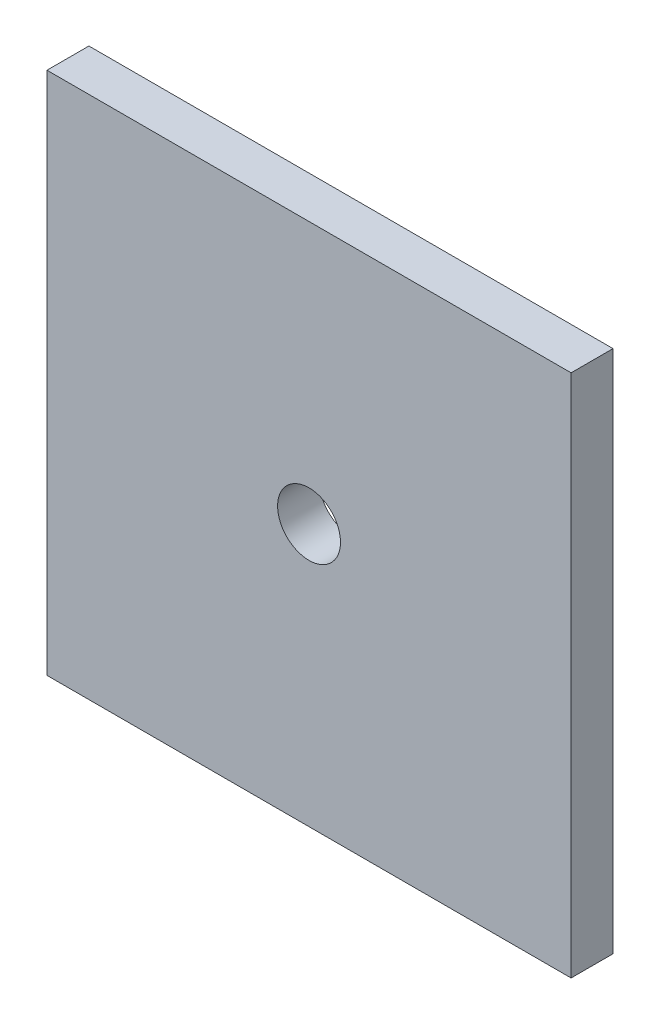
ISO-10303-21;
HEADER;
FILE_DESCRIPTION(('STEP AP214'),'2;1');
FILE_NAME('part.step','',(''),(''),'','','');
FILE_SCHEMA(('AUTOMOTIVE_DESIGN { 1 0 10303 214 1 1 1 1 }'));
ENDSEC;
DATA;
#1=APPLICATION_CONTEXT('core data for automotive mechanical design processes');
#2=APPLICATION_PROTOCOL_DEFINITION('international standard','automotive_design',2000,#1);
#3=PRODUCT_CONTEXT('',#1,'mechanical');
#4=PRODUCT('Part','Part','',(#3));
#5=PRODUCT_RELATED_PRODUCT_CATEGORY('part','',(#4));
#6=PRODUCT_DEFINITION_FORMATION('','',#4);
#7=PRODUCT_DEFINITION_CONTEXT('part definition',#1,'design');
#8=PRODUCT_DEFINITION('design','',#6,#7);
#9=PRODUCT_DEFINITION_SHAPE('','',#8);
#10=(LENGTH_UNIT() NAMED_UNIT(*) SI_UNIT(.MILLI.,.METRE.));
#11=(NAMED_UNIT(*) PLANE_ANGLE_UNIT() SI_UNIT($,.RADIAN.));
#12=(NAMED_UNIT(*) SI_UNIT($,.STERADIAN.) SOLID_ANGLE_UNIT());
#13=UNCERTAINTY_MEASURE_WITH_UNIT(LENGTH_MEASURE(1.E-05),#10,'distance_accuracy_value','');
#14=(GEOMETRIC_REPRESENTATION_CONTEXT(3) GLOBAL_UNCERTAINTY_ASSIGNED_CONTEXT((#13)) GLOBAL_UNIT_ASSIGNED_CONTEXT((#10,
#11,#12)) REPRESENTATION_CONTEXT('',''));
#15=CARTESIAN_POINT('',(0.,0.,0.));
#16=DIRECTION('',(0.,0.,1.));
#17=DIRECTION('',(1.,0.,0.));
#18=AXIS2_PLACEMENT_3D('',#15,#16,#17);
#19=CARTESIAN_POINT('',(0.,0.,4.));
#20=DIRECTION('',(1.,0.,0.));
#21=DIRECTION('',(0.,0.,-1.));
#22=AXIS2_PLACEMENT_3D('',#19,#20,#21);
#23=PLANE('',#22);
#24=DIRECTION('',(0.,-1.,0.));
#25=VECTOR('',#24,1.);
#26=CARTESIAN_POINT('',(0.,0.,0.));
#27=LINE('',#26,#25);
#28=CARTESIAN_POINT('',(0.,50.,0.));
#29=VERTEX_POINT('',#28);
#30=CARTESIAN_POINT('',(0.,0.,0.));
#31=VERTEX_POINT('',#30);
#32=EDGE_CURVE('E106',#29,#31,#27,.T.);
#33=ORIENTED_EDGE('',*,*,#32,.T.);
#34=DIRECTION('',(0.,0.,-1.));
#35=VECTOR('',#34,1.);
#36=CARTESIAN_POINT('',(0.,0.,4.));
#37=LINE('',#36,#35);
#38=CARTESIAN_POINT('',(0.,0.,4.));
#39=VERTEX_POINT('',#38);
#40=EDGE_CURVE('E11',#39,#31,#37,.T.);
#41=ORIENTED_EDGE('',*,*,#40,.F.);
#42=DIRECTION('',(0.,-1.,0.));
#43=VECTOR('',#42,1.);
#44=CARTESIAN_POINT('',(0.,0.,4.));
#45=LINE('',#44,#43);
#46=CARTESIAN_POINT('',(0.,50.,4.));
#47=VERTEX_POINT('',#46);
#48=EDGE_CURVE('E90',#47,#39,#45,.T.);
#49=ORIENTED_EDGE('',*,*,#48,.F.);
#50=DIRECTION('',(0.,0.,-1.));
#51=VECTOR('',#50,1.);
#52=CARTESIAN_POINT('',(0.,50.,4.));
#53=LINE('',#52,#51);
#54=EDGE_CURVE('E102',#47,#29,#53,.T.);
#55=ORIENTED_EDGE('',*,*,#54,.T.);
#56=EDGE_LOOP('',(#33,#41,#49,#55));
#57=FACE_BOUND('',#56,.T.);
#58=ADVANCED_FACE('F38',(#57),#23,.F.);
#59=CARTESIAN_POINT('',(0.,0.,4.));
#60=DIRECTION('',(0.,1.,0.));
#61=DIRECTION('',(0.,0.,1.));
#62=AXIS2_PLACEMENT_3D('',#59,#60,#61);
#63=PLANE('',#62);
#64=DIRECTION('',(1.,0.,0.));
#65=VECTOR('',#64,1.);
#66=CARTESIAN_POINT('',(0.,0.,0.));
#67=LINE('',#66,#65);
#68=CARTESIAN_POINT('',(50.,0.,0.));
#69=VERTEX_POINT('',#68);
#70=EDGE_CURVE('E95',#31,#69,#67,.T.);
#71=ORIENTED_EDGE('',*,*,#70,.T.);
#72=DIRECTION('',(0.,0.,-1.));
#73=VECTOR('',#72,1.);
#74=CARTESIAN_POINT('',(50.,0.,4.));
#75=LINE('',#74,#73);
#76=CARTESIAN_POINT('',(50.,0.,4.));
#77=VERTEX_POINT('',#76);
#78=EDGE_CURVE('E47',#77,#69,#75,.T.);
#79=ORIENTED_EDGE('',*,*,#78,.F.);
#80=DIRECTION('',(1.,0.,0.));
#81=VECTOR('',#80,1.);
#82=CARTESIAN_POINT('',(0.,0.,4.));
#83=LINE('',#82,#81);
#84=EDGE_CURVE('E85',#39,#77,#83,.T.);
#85=ORIENTED_EDGE('',*,*,#84,.F.);
#86=ORIENTED_EDGE('',*,*,#40,.T.);
#87=EDGE_LOOP('',(#71,#79,#85,#86));
#88=FACE_BOUND('',#87,.T.);
#89=ADVANCED_FACE('F94',(#88),#63,.F.);
#90=CARTESIAN_POINT('',(50.,0.,4.));
#91=DIRECTION('',(-1.,0.,0.));
#92=DIRECTION('',(0.,0.,1.));
#93=AXIS2_PLACEMENT_3D('',#90,#91,#92);
#94=PLANE('',#93);
#95=DIRECTION('',(0.,1.,0.));
#96=VECTOR('',#95,1.);
#97=CARTESIAN_POINT('',(50.,0.,0.));
#98=LINE('',#97,#96);
#99=CARTESIAN_POINT('',(50.,50.,0.));
#100=VERTEX_POINT('',#99);
#101=EDGE_CURVE('E72',#69,#100,#98,.T.);
#102=ORIENTED_EDGE('',*,*,#101,.T.);
#103=DIRECTION('',(0.,0.,-1.));
#104=VECTOR('',#103,1.);
#105=CARTESIAN_POINT('',(50.,50.,4.));
#106=LINE('',#105,#104);
#107=CARTESIAN_POINT('',(50.,50.,4.));
#108=VERTEX_POINT('',#107);
#109=EDGE_CURVE('E97',#108,#100,#106,.T.);
#110=ORIENTED_EDGE('',*,*,#109,.F.);
#111=DIRECTION('',(0.,1.,0.));
#112=VECTOR('',#111,1.);
#113=CARTESIAN_POINT('',(50.,0.,4.));
#114=LINE('',#113,#112);
#115=EDGE_CURVE('E88',#77,#108,#114,.T.);
#116=ORIENTED_EDGE('',*,*,#115,.F.);
#117=ORIENTED_EDGE('',*,*,#78,.T.);
#118=EDGE_LOOP('',(#102,#110,#116,#117));
#119=FACE_BOUND('',#118,.T.);
#120=ADVANCED_FACE('F98',(#119),#94,.F.);
#121=CARTESIAN_POINT('',(0.,50.,4.));
#122=DIRECTION('',(0.,-1.,0.));
#123=DIRECTION('',(0.,0.,-1.));
#124=AXIS2_PLACEMENT_3D('',#121,#122,#123);
#125=PLANE('',#124);
#126=DIRECTION('',(-1.,0.,0.));
#127=VECTOR('',#126,1.);
#128=CARTESIAN_POINT('',(0.,50.,0.));
#129=LINE('',#128,#127);
#130=EDGE_CURVE('E78',#100,#29,#129,.T.);
#131=ORIENTED_EDGE('',*,*,#130,.T.);
#132=ORIENTED_EDGE('',*,*,#54,.F.);
#133=DIRECTION('',(-1.,0.,0.));
#134=VECTOR('',#133,1.);
#135=CARTESIAN_POINT('',(0.,50.,4.));
#136=LINE('',#135,#134);
#137=EDGE_CURVE('E55',#108,#47,#136,.T.);
#138=ORIENTED_EDGE('',*,*,#137,.F.);
#139=ORIENTED_EDGE('',*,*,#109,.T.);
#140=EDGE_LOOP('',(#131,#132,#138,#139));
#141=FACE_BOUND('',#140,.T.);
#142=ADVANCED_FACE('F120',(#141),#125,.F.);
#143=CARTESIAN_POINT('',(0.,0.,4.));
#144=DIRECTION('',(0.,0.,-1.));
#145=DIRECTION('',(-1.,0.,0.));
#146=AXIS2_PLACEMENT_3D('',#143,#144,#145);
#147=PLANE('',#146);
#148=CARTESIAN_POINT('',(25.,25.,4.));
#149=DIRECTION('',(0.,0.,1.));
#150=DIRECTION('',(1.,0.,0.));
#151=AXIS2_PLACEMENT_3D('',#148,#149,#150);
#152=CIRCLE('',#151,3.);
#153=CARTESIAN_POINT('',(28.,25.,4.));
#154=VERTEX_POINT('',#153);
#155=EDGE_CURVE('E130',#154,#154,#152,.T.);
#156=ORIENTED_EDGE('',*,*,#155,.F.);
#157=EDGE_LOOP('',(#156));
#158=FACE_BOUND('',#157,.T.);
#159=ORIENTED_EDGE('',*,*,#48,.T.);
#160=ORIENTED_EDGE('',*,*,#84,.T.);
#161=ORIENTED_EDGE('',*,*,#115,.T.);
#162=ORIENTED_EDGE('',*,*,#137,.T.);
#163=EDGE_LOOP('',(#159,#160,#161,#162));
#164=FACE_BOUND('',#163,.T.);
#165=ADVANCED_FACE('F86',(#158,#164),#147,.F.);
#166=CARTESIAN_POINT('',(0.,0.,0.));
#167=DIRECTION('',(0.,0.,-1.));
#168=DIRECTION('',(-1.,0.,0.));
#169=AXIS2_PLACEMENT_3D('',#166,#167,#168);
#170=PLANE('',#169);
#171=CARTESIAN_POINT('',(25.,25.,0.));
#172=DIRECTION('',(0.,0.,-1.));
#173=DIRECTION('',(-1.,0.,0.));
#174=AXIS2_PLACEMENT_3D('',#171,#172,#173);
#175=CIRCLE('',#174,3.);
#176=CARTESIAN_POINT('',(22.,25.,0.));
#177=VERTEX_POINT('',#176);
#178=EDGE_CURVE('E110',#177,#177,#175,.F.);
#179=ORIENTED_EDGE('',*,*,#178,.T.);
#180=EDGE_LOOP('',(#179));
#181=FACE_BOUND('',#180,.T.);
#182=ORIENTED_EDGE('',*,*,#32,.F.);
#183=ORIENTED_EDGE('',*,*,#130,.F.);
#184=ORIENTED_EDGE('',*,*,#101,.F.);
#185=ORIENTED_EDGE('',*,*,#70,.F.);
#186=EDGE_LOOP('',(#182,#183,#184,#185));
#187=FACE_BOUND('',#186,.T.);
#188=ADVANCED_FACE('F123',(#181,#187),#170,.T.);
#189=CARTESIAN_POINT('',(25.,25.,-8.48528137423857));
#190=DIRECTION('',(0.,0.,1.));
#191=DIRECTION('',(1.,0.,0.));
#192=AXIS2_PLACEMENT_3D('',#189,#190,#191);
#193=CYLINDRICAL_SURFACE('',#192,3.);
#194=ORIENTED_EDGE('',*,*,#155,.T.);
#195=EDGE_LOOP('',(#194));
#196=FACE_BOUND('',#195,.T.);
#197=ORIENTED_EDGE('',*,*,#178,.F.);
#198=EDGE_LOOP('',(#197));
#199=FACE_BOUND('',#198,.T.);
#200=ADVANCED_FACE('F135',(#196,#199),#193,.F.);
#201=CLOSED_SHELL('',(#58,#89,#120,#142,#165,#188,#200));
#202=MANIFOLD_SOLID_BREP('B2',#201);
#203=ADVANCED_BREP_SHAPE_REPRESENTATION('',(#18,#202),#14);
#204=SHAPE_DEFINITION_REPRESENTATION(#9,#203);
ENDSEC;
END-ISO-10303-21;
